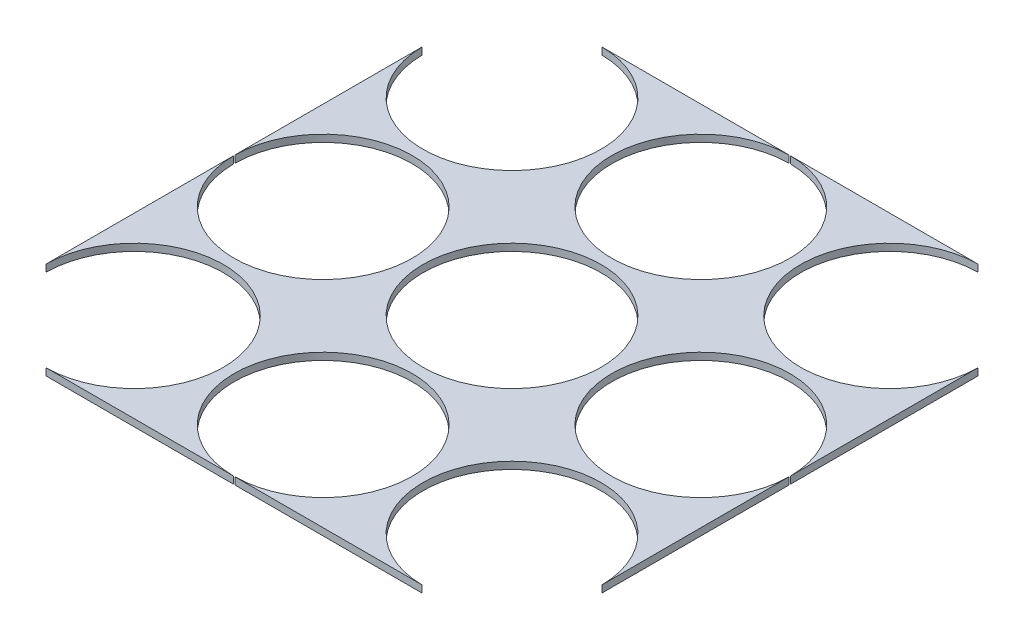
ISO-10303-21;
HEADER;
FILE_DESCRIPTION(('STEP AP214'),'2;1');
FILE_NAME('part.step','',(''),(''),'','','');
FILE_SCHEMA(('AUTOMOTIVE_DESIGN { 1 0 10303 214 1 1 1 1 }'));
ENDSEC;
DATA;
#1=APPLICATION_CONTEXT('core data for automotive mechanical design processes');
#2=APPLICATION_PROTOCOL_DEFINITION('international standard','automotive_design',2000,#1);
#3=PRODUCT_CONTEXT('',#1,'mechanical');
#4=PRODUCT('Part','Part','',(#3));
#5=PRODUCT_RELATED_PRODUCT_CATEGORY('part','',(#4));
#6=PRODUCT_DEFINITION_FORMATION('','',#4);
#7=PRODUCT_DEFINITION_CONTEXT('part definition',#1,'design');
#8=PRODUCT_DEFINITION('design','',#6,#7);
#9=PRODUCT_DEFINITION_SHAPE('','',#8);
#10=(LENGTH_UNIT() NAMED_UNIT(*) SI_UNIT(.MILLI.,.METRE.));
#11=(NAMED_UNIT(*) PLANE_ANGLE_UNIT() SI_UNIT($,.RADIAN.));
#12=(NAMED_UNIT(*) SI_UNIT($,.STERADIAN.) SOLID_ANGLE_UNIT());
#13=UNCERTAINTY_MEASURE_WITH_UNIT(LENGTH_MEASURE(1.E-05),#10,'distance_accuracy_value','');
#14=(GEOMETRIC_REPRESENTATION_CONTEXT(3) GLOBAL_UNCERTAINTY_ASSIGNED_CONTEXT((#13)) GLOBAL_UNIT_ASSIGNED_CONTEXT((#10,
#11,#12)) REPRESENTATION_CONTEXT('',''));
#15=CARTESIAN_POINT('',(0.,0.,0.));
#16=DIRECTION('',(0.,0.,1.));
#17=DIRECTION('',(1.,0.,0.));
#18=AXIS2_PLACEMENT_3D('',#15,#16,#17);
#19=CARTESIAN_POINT('',(0.,0.,0.));
#20=DIRECTION('',(0.,-1.,0.));
#21=DIRECTION('',(0.,0.,-1.));
#22=AXIS2_PLACEMENT_3D('',#19,#20,#21);
#23=PLANE('',#22);
#24=CARTESIAN_POINT('',(0.,0.,0.));
#25=DIRECTION('',(0.,1.,0.));
#26=DIRECTION('',(0.,0.,1.));
#27=AXIS2_PLACEMENT_3D('',#24,#25,#26);
#28=CIRCLE('',#27,39.6875);
#29=CARTESIAN_POINT('',(0.,0.,39.6875));
#30=VERTEX_POINT('',#29);
#31=EDGE_CURVE('E313',#30,#30,#28,.T.);
#32=ORIENTED_EDGE('',*,*,#31,.T.);
#33=EDGE_LOOP('',(#32));
#34=FACE_BOUND('',#33,.T.);
#35=DIRECTION('',(-1.,0.,0.));
#36=VECTOR('',#35,1.);
#37=CARTESIAN_POINT('',(-123.825,0.,-123.825));
#38=LINE('',#37,#36);
#39=CARTESIAN_POINT('',(-0.317497459951644,0.,-123.825));
#40=VERTEX_POINT('',#39);
#41=CARTESIAN_POINT('',(-83.8212725400479,0.,-123.825));
#42=VERTEX_POINT('',#41);
#43=EDGE_CURVE('E159',#40,#42,#38,.T.);
#44=ORIENTED_EDGE('',*,*,#43,.F.);
#45=CARTESIAN_POINT('',(-2.94960562474799E-13,0.,-84.1387699999997));
#46=DIRECTION('',(0.,-1.,0.));
#47=DIRECTION('',(0.,0.,-1.));
#48=AXIS2_PLACEMENT_3D('',#45,#46,#47);
#49=CIRCLE('',#48,39.6875);
#50=CARTESIAN_POINT('',(0.317497459951054,0.,-123.825));
#51=VERTEX_POINT('',#50);
#52=EDGE_CURVE('E59',#40,#51,#49,.F.);
#53=ORIENTED_EDGE('',*,*,#52,.T.);
#54=CARTESIAN_POINT('',(83.82127254005,0.,-123.825));
#55=VERTEX_POINT('',#54);
#56=EDGE_CURVE('E200',#55,#51,#38,.T.);
#57=ORIENTED_EDGE('',*,*,#56,.F.);
#58=CARTESIAN_POINT('',(84.1387699999997,0.,-84.1387699999997));
#59=DIRECTION('',(0.,-1.,0.));
#60=DIRECTION('',(0.,0.,-1.));
#61=AXIS2_PLACEMENT_3D('',#58,#59,#60);
#62=CIRCLE('',#61,39.6875);
#63=CARTESIAN_POINT('',(123.825,0.,-83.8212725400518));
#64=VERTEX_POINT('',#63);
#65=EDGE_CURVE('E205',#64,#55,#62,.T.);
#66=ORIENTED_EDGE('',*,*,#65,.F.);
#67=DIRECTION('',(0.,0.,-1.));
#68=VECTOR('',#67,1.);
#69=CARTESIAN_POINT('',(123.825,0.,123.825));
#70=LINE('',#69,#68);
#71=CARTESIAN_POINT('',(123.825,0.,-0.317497459985839));
#72=VERTEX_POINT('',#71);
#73=EDGE_CURVE('E399',#72,#64,#70,.T.);
#74=ORIENTED_EDGE('',*,*,#73,.F.);
#75=CARTESIAN_POINT('',(84.13877,0.,0.));
#76=DIRECTION('',(0.,-1.,0.));
#77=DIRECTION('',(0.,0.,-1.));
#78=AXIS2_PLACEMENT_3D('',#75,#76,#77);
#79=CIRCLE('',#78,39.6875);
#80=CARTESIAN_POINT('',(123.825,0.,0.317497459985839));
#81=VERTEX_POINT('',#80);
#82=EDGE_CURVE('E151',#81,#72,#79,.T.);
#83=ORIENTED_EDGE('',*,*,#82,.F.);
#84=CARTESIAN_POINT('',(123.825,0.,83.8212725399048));
#85=VERTEX_POINT('',#84);
#86=EDGE_CURVE('E285',#85,#81,#70,.T.);
#87=ORIENTED_EDGE('',*,*,#86,.F.);
#88=CARTESIAN_POINT('',(84.1387700000009,0.,84.1387700000003));
#89=DIRECTION('',(0.,1.,0.));
#90=DIRECTION('',(0.,0.,1.));
#91=AXIS2_PLACEMENT_3D('',#88,#89,#90);
#92=CIRCLE('',#91,39.6875);
#93=CARTESIAN_POINT('',(83.8212725399734,0.,123.825));
#94=VERTEX_POINT('',#93);
#95=EDGE_CURVE('E250',#94,#85,#92,.F.);
#96=ORIENTED_EDGE('',*,*,#95,.F.);
#97=DIRECTION('',(1.,0.,0.));
#98=VECTOR('',#97,1.);
#99=CARTESIAN_POINT('',(-123.825,0.,123.825));
#100=LINE('',#99,#98);
#101=CARTESIAN_POINT('',(0.31749746002837,0.,123.825));
#102=VERTEX_POINT('',#101);
#103=EDGE_CURVE('E249',#102,#94,#100,.T.);
#104=ORIENTED_EDGE('',*,*,#103,.F.);
#105=CARTESIAN_POINT('',(8.69811191301592E-13,0.,84.1387700000003));
#106=DIRECTION('',(0.,1.,0.));
#107=DIRECTION('',(0.,0.,1.));
#108=AXIS2_PLACEMENT_3D('',#105,#106,#107);
#109=CIRCLE('',#108,39.6875);
#110=CARTESIAN_POINT('',(-0.31749746002663,0.,123.825));
#111=VERTEX_POINT('',#110);
#112=EDGE_CURVE('E307',#102,#111,#109,.T.);
#113=ORIENTED_EDGE('',*,*,#112,.T.);
#114=CARTESIAN_POINT('',(-83.8212725399716,0.,123.825));
#115=VERTEX_POINT('',#114);
#116=EDGE_CURVE('E196',#115,#111,#100,.T.);
#117=ORIENTED_EDGE('',*,*,#116,.F.);
#118=CARTESIAN_POINT('',(-84.1387699999991,0.,84.1387700000003));
#119=DIRECTION('',(0.,1.,0.));
#120=DIRECTION('',(0.,0.,1.));
#121=AXIS2_PLACEMENT_3D('',#118,#119,#120);
#122=CIRCLE('',#121,39.6875);
#123=CARTESIAN_POINT('',(-123.825,0.,83.8212725401165));
#124=VERTEX_POINT('',#123);
#125=EDGE_CURVE('E302',#115,#124,#122,.T.);
#126=ORIENTED_EDGE('',*,*,#125,.T.);
#127=DIRECTION('',(0.,0.,1.));
#128=VECTOR('',#127,1.);
#129=CARTESIAN_POINT('',(-123.825,0.,123.825));
#130=LINE('',#129,#128);
#131=CARTESIAN_POINT('',(-123.825,0.,0.31749745999301));
#132=VERTEX_POINT('',#131);
#133=EDGE_CURVE('E216',#132,#124,#130,.T.);
#134=ORIENTED_EDGE('',*,*,#133,.F.);
#135=CARTESIAN_POINT('',(-84.13877,0.,0.));
#136=DIRECTION('',(0.,-1.,0.));
#137=DIRECTION('',(0.,0.,-1.));
#138=AXIS2_PLACEMENT_3D('',#135,#136,#137);
#139=CIRCLE('',#138,39.6875);
#140=CARTESIAN_POINT('',(-123.825,0.,-0.31749745999301));
#141=VERTEX_POINT('',#140);
#142=EDGE_CURVE('E175',#132,#141,#139,.F.);
#143=ORIENTED_EDGE('',*,*,#142,.T.);
#144=CARTESIAN_POINT('',(-123.825,0.,-83.8212725399695));
#145=VERTEX_POINT('',#144);
#146=EDGE_CURVE('E214',#145,#141,#130,.T.);
#147=ORIENTED_EDGE('',*,*,#146,.F.);
#148=CARTESIAN_POINT('',(-84.1387700000003,0.,-84.1387699999997));
#149=DIRECTION('',(0.,-1.,0.));
#150=DIRECTION('',(0.,0.,-1.));
#151=AXIS2_PLACEMENT_3D('',#148,#149,#150);
#152=CIRCLE('',#151,39.6875);
#153=EDGE_CURVE('E169',#145,#42,#152,.F.);
#154=ORIENTED_EDGE('',*,*,#153,.T.);
#155=EDGE_LOOP('',(#44,#53,#57,#66,#74,#83,#87,#96,#104,#113,#117,#126,#134,#143,#147,#154));
#156=FACE_BOUND('',#155,.T.);
#157=ADVANCED_FACE('F40',(#34,#156),#23,.T.);
#158=CARTESIAN_POINT('',(0.,3.175,0.));
#159=DIRECTION('',(0.,-1.,0.));
#160=DIRECTION('',(0.,0.,-1.));
#161=AXIS2_PLACEMENT_3D('',#158,#159,#160);
#162=PLANE('',#161);
#163=CARTESIAN_POINT('',(-2.94960562474799E-13,3.175,-84.1387699999997));
#164=DIRECTION('',(0.,1.,0.));
#165=DIRECTION('',(0.,0.,1.));
#166=AXIS2_PLACEMENT_3D('',#163,#164,#165);
#167=CIRCLE('',#166,39.6875);
#168=CARTESIAN_POINT('',(-0.317497459951644,3.175,-123.825));
#169=VERTEX_POINT('',#168);
#170=CARTESIAN_POINT('',(0.317497459951054,3.175,-123.825));
#171=VERTEX_POINT('',#170);
#172=EDGE_CURVE('E51',#169,#171,#167,.T.);
#173=ORIENTED_EDGE('',*,*,#172,.F.);
#174=DIRECTION('',(-1.,0.,0.));
#175=VECTOR('',#174,1.);
#176=CARTESIAN_POINT('',(-123.825,3.175,-123.825));
#177=LINE('',#176,#175);
#178=CARTESIAN_POINT('',(-83.8212725400479,3.175,-123.825));
#179=VERTEX_POINT('',#178);
#180=EDGE_CURVE('E157',#169,#179,#177,.T.);
#181=ORIENTED_EDGE('',*,*,#180,.T.);
#182=CARTESIAN_POINT('',(-84.1387700000003,3.175,-84.1387699999997));
#183=DIRECTION('',(0.,1.,0.));
#184=DIRECTION('',(0.,0.,1.));
#185=AXIS2_PLACEMENT_3D('',#182,#183,#184);
#186=CIRCLE('',#185,39.6875);
#187=CARTESIAN_POINT('',(-123.825,3.175,-83.8212725399695));
#188=VERTEX_POINT('',#187);
#189=EDGE_CURVE('E141',#188,#179,#186,.T.);
#190=ORIENTED_EDGE('',*,*,#189,.F.);
#191=DIRECTION('',(0.,0.,1.));
#192=VECTOR('',#191,1.);
#193=CARTESIAN_POINT('',(-123.825,3.175,123.825));
#194=LINE('',#193,#192);
#195=CARTESIAN_POINT('',(-123.825,3.175,-0.31749745999301));
#196=VERTEX_POINT('',#195);
#197=EDGE_CURVE('E168',#188,#196,#194,.T.);
#198=ORIENTED_EDGE('',*,*,#197,.T.);
#199=CARTESIAN_POINT('',(-84.13877,3.175,0.));
#200=DIRECTION('',(0.,1.,0.));
#201=DIRECTION('',(0.,0.,1.));
#202=AXIS2_PLACEMENT_3D('',#199,#200,#201);
#203=CIRCLE('',#202,39.6875);
#204=CARTESIAN_POINT('',(-123.825,3.175,0.31749745999301));
#205=VERTEX_POINT('',#204);
#206=EDGE_CURVE('E358',#205,#196,#203,.T.);
#207=ORIENTED_EDGE('',*,*,#206,.F.);
#208=CARTESIAN_POINT('',(-123.825,3.175,83.8212725401165));
#209=VERTEX_POINT('',#208);
#210=EDGE_CURVE('E173',#205,#209,#194,.T.);
#211=ORIENTED_EDGE('',*,*,#210,.T.);
#212=CARTESIAN_POINT('',(-84.1387699999991,3.175,84.1387700000003));
#213=DIRECTION('',(0.,1.,0.));
#214=DIRECTION('',(0.,0.,1.));
#215=AXIS2_PLACEMENT_3D('',#212,#213,#214);
#216=CIRCLE('',#215,39.6875);
#217=CARTESIAN_POINT('',(-83.8212725399716,3.175,123.825));
#218=VERTEX_POINT('',#217);
#219=EDGE_CURVE('E308',#218,#209,#216,.T.);
#220=ORIENTED_EDGE('',*,*,#219,.F.);
#221=DIRECTION('',(1.,0.,0.));
#222=VECTOR('',#221,1.);
#223=CARTESIAN_POINT('',(-123.825,3.175,123.825));
#224=LINE('',#223,#222);
#225=CARTESIAN_POINT('',(-0.31749746002663,3.175,123.825));
#226=VERTEX_POINT('',#225);
#227=EDGE_CURVE('E321',#218,#226,#224,.T.);
#228=ORIENTED_EDGE('',*,*,#227,.T.);
#229=CARTESIAN_POINT('',(8.69811191301592E-13,3.175,84.1387700000003));
#230=DIRECTION('',(0.,1.,0.));
#231=DIRECTION('',(0.,0.,1.));
#232=AXIS2_PLACEMENT_3D('',#229,#230,#231);
#233=CIRCLE('',#232,39.6875);
#234=CARTESIAN_POINT('',(0.31749746002837,3.175,123.825));
#235=VERTEX_POINT('',#234);
#236=EDGE_CURVE('E252',#235,#226,#233,.T.);
#237=ORIENTED_EDGE('',*,*,#236,.F.);
#238=CARTESIAN_POINT('',(83.8212725399734,3.175,123.825));
#239=VERTEX_POINT('',#238);
#240=EDGE_CURVE('E242',#235,#239,#224,.T.);
#241=ORIENTED_EDGE('',*,*,#240,.T.);
#242=CARTESIAN_POINT('',(84.1387700000009,3.175,84.1387700000003));
#243=DIRECTION('',(0.,1.,0.));
#244=DIRECTION('',(0.,0.,1.));
#245=AXIS2_PLACEMENT_3D('',#242,#243,#244);
#246=CIRCLE('',#245,39.6875);
#247=CARTESIAN_POINT('',(123.825,3.175,83.8212725399048));
#248=VERTEX_POINT('',#247);
#249=EDGE_CURVE('E235',#239,#248,#246,.F.);
#250=ORIENTED_EDGE('',*,*,#249,.T.);
#251=DIRECTION('',(0.,0.,-1.));
#252=VECTOR('',#251,1.);
#253=CARTESIAN_POINT('',(123.825,3.175,123.825));
#254=LINE('',#253,#252);
#255=CARTESIAN_POINT('',(123.825,3.175,0.317497459985839));
#256=VERTEX_POINT('',#255);
#257=EDGE_CURVE('E269',#248,#256,#254,.T.);
#258=ORIENTED_EDGE('',*,*,#257,.T.);
#259=CARTESIAN_POINT('',(84.13877,3.175,0.));
#260=DIRECTION('',(0.,1.,0.));
#261=DIRECTION('',(0.,0.,1.));
#262=AXIS2_PLACEMENT_3D('',#259,#260,#261);
#263=CIRCLE('',#262,39.6875);
#264=CARTESIAN_POINT('',(123.825,3.175,-0.317497459985839));
#265=VERTEX_POINT('',#264);
#266=EDGE_CURVE('E276',#256,#265,#263,.F.);
#267=ORIENTED_EDGE('',*,*,#266,.T.);
#268=CARTESIAN_POINT('',(123.825,3.175,-83.8212725400518));
#269=VERTEX_POINT('',#268);
#270=EDGE_CURVE('E272',#265,#269,#254,.T.);
#271=ORIENTED_EDGE('',*,*,#270,.T.);
#272=CARTESIAN_POINT('',(84.1387699999997,3.175,-84.1387699999997));
#273=DIRECTION('',(0.,1.,0.));
#274=DIRECTION('',(0.,0.,1.));
#275=AXIS2_PLACEMENT_3D('',#272,#273,#274);
#276=CIRCLE('',#275,39.6875);
#277=CARTESIAN_POINT('',(83.82127254005,3.175,-123.825));
#278=VERTEX_POINT('',#277);
#279=EDGE_CURVE('E197',#269,#278,#276,.F.);
#280=ORIENTED_EDGE('',*,*,#279,.T.);
#281=EDGE_CURVE('E192',#278,#171,#177,.T.);
#282=ORIENTED_EDGE('',*,*,#281,.T.);
#283=EDGE_LOOP('',(#173,#181,#190,#198,#207,#211,#220,#228,#237,#241,#250,#258,#267,#271,#280,#282));
#284=FACE_BOUND('',#283,.T.);
#285=CARTESIAN_POINT('',(0.,3.175,0.));
#286=DIRECTION('',(0.,1.,0.));
#287=DIRECTION('',(0.,0.,1.));
#288=AXIS2_PLACEMENT_3D('',#285,#286,#287);
#289=CIRCLE('',#288,39.6875);
#290=CARTESIAN_POINT('',(0.,3.175,39.6875));
#291=VERTEX_POINT('',#290);
#292=EDGE_CURVE('E370',#291,#291,#289,.T.);
#293=ORIENTED_EDGE('',*,*,#292,.F.);
#294=EDGE_LOOP('',(#293));
#295=FACE_BOUND('',#294,.T.);
#296=ADVANCED_FACE('F164',(#284,#295),#162,.F.);
#297=CARTESIAN_POINT('',(-123.825,3.175,123.825));
#298=DIRECTION('',(0.,0.,-1.));
#299=DIRECTION('',(-1.,0.,0.));
#300=AXIS2_PLACEMENT_3D('',#297,#298,#299);
#301=PLANE('',#300);
#302=DIRECTION('',(0.,-1.,0.));
#303=VECTOR('',#302,1.);
#304=CARTESIAN_POINT('',(-0.31749746002663,3.175,123.825));
#305=LINE('',#304,#303);
#306=EDGE_CURVE('E256',#226,#111,#305,.T.);
#307=ORIENTED_EDGE('',*,*,#306,.F.);
#308=ORIENTED_EDGE('',*,*,#227,.F.);
#309=DIRECTION('',(0.,-1.,0.));
#310=VECTOR('',#309,1.);
#311=CARTESIAN_POINT('',(-83.8212725399716,3.175,123.825));
#312=LINE('',#311,#310);
#313=EDGE_CURVE('E228',#115,#218,#312,.F.);
#314=ORIENTED_EDGE('',*,*,#313,.F.);
#315=ORIENTED_EDGE('',*,*,#116,.T.);
#316=EDGE_LOOP('',(#307,#308,#314,#315));
#317=FACE_BOUND('',#316,.T.);
#318=ADVANCED_FACE('F445',(#317),#301,.F.);
#319=ORIENTED_EDGE('',*,*,#103,.T.);
#320=DIRECTION('',(0.,-1.,0.));
#321=VECTOR('',#320,1.);
#322=CARTESIAN_POINT('',(83.8212725399734,3.175,123.825));
#323=LINE('',#322,#321);
#324=EDGE_CURVE('E245',#94,#239,#323,.F.);
#325=ORIENTED_EDGE('',*,*,#324,.T.);
#326=ORIENTED_EDGE('',*,*,#240,.F.);
#327=DIRECTION('',(0.,-1.,0.));
#328=VECTOR('',#327,1.);
#329=CARTESIAN_POINT('',(0.31749746002837,3.175,123.825));
#330=LINE('',#329,#328);
#331=EDGE_CURVE('E257',#102,#235,#330,.F.);
#332=ORIENTED_EDGE('',*,*,#331,.F.);
#333=EDGE_LOOP('',(#319,#325,#326,#332));
#334=FACE_BOUND('',#333,.T.);
#335=ADVANCED_FACE('F462',(#334),#301,.F.);
#336=CARTESIAN_POINT('',(-123.825,3.175,123.825));
#337=DIRECTION('',(1.,0.,0.));
#338=DIRECTION('',(0.,0.,-1.));
#339=AXIS2_PLACEMENT_3D('',#336,#337,#338);
#340=PLANE('',#339);
#341=DIRECTION('',(0.,-1.,0.));
#342=VECTOR('',#341,1.);
#343=CARTESIAN_POINT('',(-123.825,3.175,-0.31749745999301));
#344=LINE('',#343,#342);
#345=EDGE_CURVE('E229',#196,#141,#344,.T.);
#346=ORIENTED_EDGE('',*,*,#345,.F.);
#347=ORIENTED_EDGE('',*,*,#197,.F.);
#348=DIRECTION('',(0.,-1.,0.));
#349=VECTOR('',#348,1.);
#350=CARTESIAN_POINT('',(-123.825,3.175,-83.8212725399695));
#351=LINE('',#350,#349);
#352=EDGE_CURVE('E138',#145,#188,#351,.F.);
#353=ORIENTED_EDGE('',*,*,#352,.F.);
#354=ORIENTED_EDGE('',*,*,#146,.T.);
#355=EDGE_LOOP('',(#346,#347,#353,#354));
#356=FACE_BOUND('',#355,.T.);
#357=ADVANCED_FACE('F458',(#356),#340,.F.);
#358=DIRECTION('',(0.,-1.,0.));
#359=VECTOR('',#358,1.);
#360=CARTESIAN_POINT('',(-123.825,3.175,0.31749745999301));
#361=LINE('',#360,#359);
#362=EDGE_CURVE('E368',#132,#205,#361,.F.);
#363=ORIENTED_EDGE('',*,*,#362,.F.);
#364=ORIENTED_EDGE('',*,*,#133,.T.);
#365=DIRECTION('',(0.,-1.,0.));
#366=VECTOR('',#365,1.);
#367=CARTESIAN_POINT('',(-123.825,3.175,83.8212725401165));
#368=LINE('',#367,#366);
#369=EDGE_CURVE('E224',#209,#124,#368,.T.);
#370=ORIENTED_EDGE('',*,*,#369,.F.);
#371=ORIENTED_EDGE('',*,*,#210,.F.);
#372=EDGE_LOOP('',(#363,#364,#370,#371));
#373=FACE_BOUND('',#372,.T.);
#374=ADVANCED_FACE('F437',(#373),#340,.F.);
#375=CARTESIAN_POINT('',(-123.825,3.175,-123.825));
#376=DIRECTION('',(0.,0.,1.));
#377=DIRECTION('',(1.,0.,0.));
#378=AXIS2_PLACEMENT_3D('',#375,#376,#377);
#379=PLANE('',#378);
#380=DIRECTION('',(0.,-1.,0.));
#381=VECTOR('',#380,1.);
#382=CARTESIAN_POINT('',(-0.317497459951644,3.175,-123.825));
#383=LINE('',#382,#381);
#384=EDGE_CURVE('E348',#40,#169,#383,.F.);
#385=ORIENTED_EDGE('',*,*,#384,.F.);
#386=ORIENTED_EDGE('',*,*,#43,.T.);
#387=DIRECTION('',(0.,-1.,0.));
#388=VECTOR('',#387,1.);
#389=CARTESIAN_POINT('',(-83.8212725400479,3.175,-123.825));
#390=LINE('',#389,#388);
#391=EDGE_CURVE('E144',#179,#42,#390,.T.);
#392=ORIENTED_EDGE('',*,*,#391,.F.);
#393=ORIENTED_EDGE('',*,*,#180,.F.);
#394=EDGE_LOOP('',(#385,#386,#392,#393));
#395=FACE_BOUND('',#394,.T.);
#396=ADVANCED_FACE('F156',(#395),#379,.F.);
#397=DIRECTION('',(0.,-1.,0.));
#398=VECTOR('',#397,1.);
#399=CARTESIAN_POINT('',(0.317497459951054,3.175,-123.825));
#400=LINE('',#399,#398);
#401=EDGE_CURVE('E11',#171,#51,#400,.T.);
#402=ORIENTED_EDGE('',*,*,#401,.F.);
#403=ORIENTED_EDGE('',*,*,#281,.F.);
#404=DIRECTION('',(0.,-1.,0.));
#405=VECTOR('',#404,1.);
#406=CARTESIAN_POINT('',(83.82127254005,3.175,-123.825));
#407=LINE('',#406,#405);
#408=EDGE_CURVE('E204',#278,#55,#407,.T.);
#409=ORIENTED_EDGE('',*,*,#408,.T.);
#410=ORIENTED_EDGE('',*,*,#56,.T.);
#411=EDGE_LOOP('',(#402,#403,#409,#410));
#412=FACE_BOUND('',#411,.T.);
#413=ADVANCED_FACE('F485',(#412),#379,.F.);
#414=CARTESIAN_POINT('',(123.825,3.175,123.825));
#415=DIRECTION('',(-1.,0.,0.));
#416=DIRECTION('',(0.,0.,1.));
#417=AXIS2_PLACEMENT_3D('',#414,#415,#416);
#418=PLANE('',#417);
#419=ORIENTED_EDGE('',*,*,#257,.F.);
#420=DIRECTION('',(0.,-1.,0.));
#421=VECTOR('',#420,1.);
#422=CARTESIAN_POINT('',(123.825,3.175,83.8212725399048));
#423=LINE('',#422,#421);
#424=EDGE_CURVE('E203',#248,#85,#423,.T.);
#425=ORIENTED_EDGE('',*,*,#424,.T.);
#426=ORIENTED_EDGE('',*,*,#86,.T.);
#427=DIRECTION('',(0.,-1.,0.));
#428=VECTOR('',#427,1.);
#429=CARTESIAN_POINT('',(123.825,3.175,0.317497459985839));
#430=LINE('',#429,#428);
#431=EDGE_CURVE('E396',#81,#256,#430,.F.);
#432=ORIENTED_EDGE('',*,*,#431,.T.);
#433=EDGE_LOOP('',(#419,#425,#426,#432));
#434=FACE_BOUND('',#433,.T.);
#435=ADVANCED_FACE('F390',(#434),#418,.F.);
#436=ORIENTED_EDGE('',*,*,#73,.T.);
#437=DIRECTION('',(0.,-1.,0.));
#438=VECTOR('',#437,1.);
#439=CARTESIAN_POINT('',(123.825,3.175,-83.8212725400518));
#440=LINE('',#439,#438);
#441=EDGE_CURVE('E286',#64,#269,#440,.F.);
#442=ORIENTED_EDGE('',*,*,#441,.T.);
#443=ORIENTED_EDGE('',*,*,#270,.F.);
#444=DIRECTION('',(0.,-1.,0.));
#445=VECTOR('',#444,1.);
#446=CARTESIAN_POINT('',(123.825,3.175,-0.317497459985839));
#447=LINE('',#446,#445);
#448=EDGE_CURVE('E161',#265,#72,#447,.T.);
#449=ORIENTED_EDGE('',*,*,#448,.T.);
#450=EDGE_LOOP('',(#436,#442,#443,#449));
#451=FACE_BOUND('',#450,.T.);
#452=ADVANCED_FACE('F413',(#451),#418,.F.);
#453=CARTESIAN_POINT('',(-84.1387700000003,3.175,-84.1387699999997));
#454=DIRECTION('',(0.,-1.,0.));
#455=DIRECTION('',(0.,0.,-1.));
#456=AXIS2_PLACEMENT_3D('',#453,#454,#455);
#457=CYLINDRICAL_SURFACE('',#456,39.6875);
#458=ORIENTED_EDGE('',*,*,#391,.T.);
#459=ORIENTED_EDGE('',*,*,#153,.F.);
#460=ORIENTED_EDGE('',*,*,#352,.T.);
#461=ORIENTED_EDGE('',*,*,#189,.T.);
#462=EDGE_LOOP('',(#458,#459,#460,#461));
#463=FACE_BOUND('',#462,.T.);
#464=ADVANCED_FACE('F143',(#463),#457,.F.);
#465=CARTESIAN_POINT('',(84.13877,3.175,0.));
#466=DIRECTION('',(0.,-1.,0.));
#467=DIRECTION('',(0.,0.,-1.));
#468=AXIS2_PLACEMENT_3D('',#465,#466,#467);
#469=CYLINDRICAL_SURFACE('',#468,39.6875);
#470=ORIENTED_EDGE('',*,*,#266,.F.);
#471=ORIENTED_EDGE('',*,*,#431,.F.);
#472=ORIENTED_EDGE('',*,*,#82,.T.);
#473=ORIENTED_EDGE('',*,*,#448,.F.);
#474=EDGE_LOOP('',(#470,#471,#472,#473));
#475=FACE_BOUND('',#474,.T.);
#476=ADVANCED_FACE('F409',(#475),#469,.F.);
#477=CARTESIAN_POINT('',(-84.1387699999991,3.175,84.1387700000003));
#478=DIRECTION('',(0.,-1.,0.));
#479=DIRECTION('',(0.,0.,-1.));
#480=AXIS2_PLACEMENT_3D('',#477,#478,#479);
#481=CYLINDRICAL_SURFACE('',#480,39.6875);
#482=ORIENTED_EDGE('',*,*,#369,.T.);
#483=ORIENTED_EDGE('',*,*,#125,.F.);
#484=ORIENTED_EDGE('',*,*,#313,.T.);
#485=ORIENTED_EDGE('',*,*,#219,.T.);
#486=EDGE_LOOP('',(#482,#483,#484,#485));
#487=FACE_BOUND('',#486,.T.);
#488=ADVANCED_FACE('F440',(#487),#481,.F.);
#489=CARTESIAN_POINT('',(8.69811191301592E-13,3.175,84.1387700000003));
#490=DIRECTION('',(0.,-1.,0.));
#491=DIRECTION('',(0.,0.,-1.));
#492=AXIS2_PLACEMENT_3D('',#489,#490,#491);
#493=CYLINDRICAL_SURFACE('',#492,39.6875);
#494=ORIENTED_EDGE('',*,*,#331,.T.);
#495=ORIENTED_EDGE('',*,*,#236,.T.);
#496=ORIENTED_EDGE('',*,*,#306,.T.);
#497=ORIENTED_EDGE('',*,*,#112,.F.);
#498=EDGE_LOOP('',(#494,#495,#496,#497));
#499=FACE_BOUND('',#498,.T.);
#500=ADVANCED_FACE('F512',(#499),#493,.F.);
#501=CARTESIAN_POINT('',(84.1387700000009,3.175,84.1387700000003));
#502=DIRECTION('',(0.,-1.,0.));
#503=DIRECTION('',(0.,0.,-1.));
#504=AXIS2_PLACEMENT_3D('',#501,#502,#503);
#505=CYLINDRICAL_SURFACE('',#504,39.6875);
#506=ORIENTED_EDGE('',*,*,#249,.F.);
#507=ORIENTED_EDGE('',*,*,#324,.F.);
#508=ORIENTED_EDGE('',*,*,#95,.T.);
#509=ORIENTED_EDGE('',*,*,#424,.F.);
#510=EDGE_LOOP('',(#506,#507,#508,#509));
#511=FACE_BOUND('',#510,.T.);
#512=ADVANCED_FACE('F384',(#511),#505,.F.);
#513=CARTESIAN_POINT('',(0.,3.175,0.));
#514=DIRECTION('',(0.,-1.,0.));
#515=DIRECTION('',(0.,0.,-1.));
#516=AXIS2_PLACEMENT_3D('',#513,#514,#515);
#517=CYLINDRICAL_SURFACE('',#516,39.6875);
#518=ORIENTED_EDGE('',*,*,#292,.T.);
#519=EDGE_LOOP('',(#518));
#520=FACE_BOUND('',#519,.T.);
#521=ORIENTED_EDGE('',*,*,#31,.F.);
#522=EDGE_LOOP('',(#521));
#523=FACE_BOUND('',#522,.T.);
#524=ADVANCED_FACE('F503',(#520,#523),#517,.F.);
#525=CARTESIAN_POINT('',(-84.13877,3.175,0.));
#526=DIRECTION('',(0.,-1.,0.));
#527=DIRECTION('',(0.,0.,-1.));
#528=AXIS2_PLACEMENT_3D('',#525,#526,#527);
#529=CYLINDRICAL_SURFACE('',#528,39.6875);
#530=ORIENTED_EDGE('',*,*,#362,.T.);
#531=ORIENTED_EDGE('',*,*,#206,.T.);
#532=ORIENTED_EDGE('',*,*,#345,.T.);
#533=ORIENTED_EDGE('',*,*,#142,.F.);
#534=EDGE_LOOP('',(#530,#531,#532,#533));
#535=FACE_BOUND('',#534,.T.);
#536=ADVANCED_FACE('F453',(#535),#529,.F.);
#537=CARTESIAN_POINT('',(84.1387699999997,3.175,-84.1387699999997));
#538=DIRECTION('',(0.,-1.,0.));
#539=DIRECTION('',(0.,0.,-1.));
#540=AXIS2_PLACEMENT_3D('',#537,#538,#539);
#541=CYLINDRICAL_SURFACE('',#540,39.6875);
#542=ORIENTED_EDGE('',*,*,#65,.T.);
#543=ORIENTED_EDGE('',*,*,#408,.F.);
#544=ORIENTED_EDGE('',*,*,#279,.F.);
#545=ORIENTED_EDGE('',*,*,#441,.F.);
#546=EDGE_LOOP('',(#542,#543,#544,#545));
#547=FACE_BOUND('',#546,.T.);
#548=ADVANCED_FACE('F42',(#547),#541,.F.);
#549=CARTESIAN_POINT('',(-2.94960562474799E-13,3.175,-84.1387699999997));
#550=DIRECTION('',(0.,-1.,0.));
#551=DIRECTION('',(0.,0.,-1.));
#552=AXIS2_PLACEMENT_3D('',#549,#550,#551);
#553=CYLINDRICAL_SURFACE('',#552,39.6875);
#554=ORIENTED_EDGE('',*,*,#384,.T.);
#555=ORIENTED_EDGE('',*,*,#172,.T.);
#556=ORIENTED_EDGE('',*,*,#401,.T.);
#557=ORIENTED_EDGE('',*,*,#52,.F.);
#558=EDGE_LOOP('',(#554,#555,#556,#557));
#559=FACE_BOUND('',#558,.T.);
#560=ADVANCED_FACE('F494',(#559),#553,.F.);
#561=CLOSED_SHELL('',(#157,#296,#318,#335,#357,#374,#396,#413,#435,#452,#464,#476,#488,#500,
#512,#524,#536,#548,#560));
#562=MANIFOLD_SOLID_BREP('B2',#561);
#563=ADVANCED_BREP_SHAPE_REPRESENTATION('',(#18,#562),#14);
#564=SHAPE_DEFINITION_REPRESENTATION(#9,#563);
ENDSEC;
END-ISO-10303-21;
